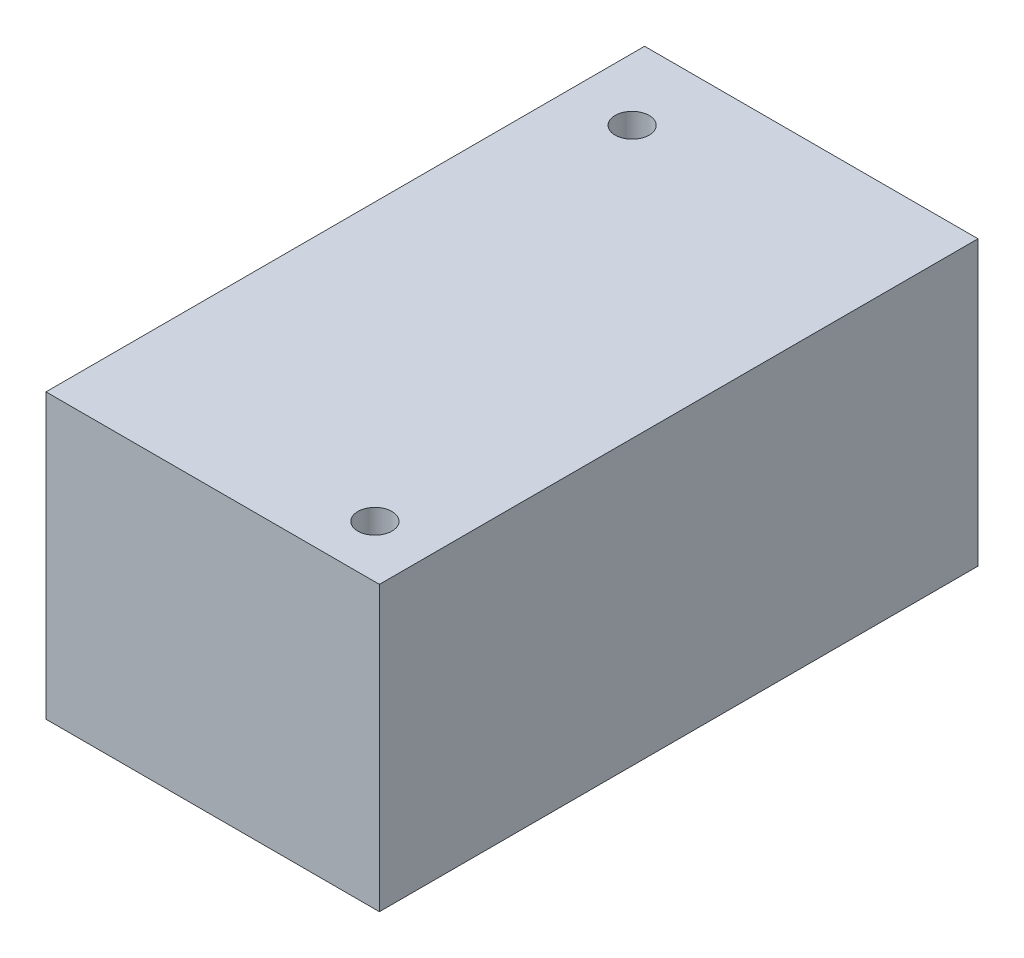
ISO-10303-21;
HEADER;
FILE_DESCRIPTION(('STEP AP214'),'2;1');
FILE_NAME('part.step','',(''),(''),'','','');
FILE_SCHEMA(('AUTOMOTIVE_DESIGN { 1 0 10303 214 1 1 1 1 }'));
ENDSEC;
DATA;
#1=APPLICATION_CONTEXT('core data for automotive mechanical design processes');
#2=APPLICATION_PROTOCOL_DEFINITION('international standard','automotive_design',2000,#1);
#3=PRODUCT_CONTEXT('',#1,'mechanical');
#4=PRODUCT('Part','Part','',(#3));
#5=PRODUCT_RELATED_PRODUCT_CATEGORY('part','',(#4));
#6=PRODUCT_DEFINITION_FORMATION('','',#4);
#7=PRODUCT_DEFINITION_CONTEXT('part definition',#1,'design');
#8=PRODUCT_DEFINITION('design','',#6,#7);
#9=PRODUCT_DEFINITION_SHAPE('','',#8);
#10=(LENGTH_UNIT() NAMED_UNIT(*) SI_UNIT(.MILLI.,.METRE.));
#11=(NAMED_UNIT(*) PLANE_ANGLE_UNIT() SI_UNIT($,.RADIAN.));
#12=(NAMED_UNIT(*) SI_UNIT($,.STERADIAN.) SOLID_ANGLE_UNIT());
#13=UNCERTAINTY_MEASURE_WITH_UNIT(LENGTH_MEASURE(1.E-05),#10,'distance_accuracy_value','');
#14=(GEOMETRIC_REPRESENTATION_CONTEXT(3) GLOBAL_UNCERTAINTY_ASSIGNED_CONTEXT((#13)) GLOBAL_UNIT_ASSIGNED_CONTEXT((#10,
#11,#12)) REPRESENTATION_CONTEXT('',''));
#15=CARTESIAN_POINT('',(0.,0.,0.));
#16=DIRECTION('',(0.,0.,1.));
#17=DIRECTION('',(1.,0.,0.));
#18=AXIS2_PLACEMENT_3D('',#15,#16,#17);
#19=CARTESIAN_POINT('',(63.5,45.,228.));
#20=DIRECTION('',(-1.,0.,0.));
#21=DIRECTION('',(0.,-1.,0.));
#22=AXIS2_PLACEMENT_3D('',#19,#20,#21);
#23=PLANE('',#22);
#24=DIRECTION('',(0.,1.,0.));
#25=VECTOR('',#24,1.);
#26=CARTESIAN_POINT('',(63.5,45.,0.));
#27=LINE('',#26,#25);
#28=CARTESIAN_POINT('',(63.5,-45.,0.));
#29=VERTEX_POINT('',#28);
#30=CARTESIAN_POINT('',(63.5,63.,0.));
#31=VERTEX_POINT('',#30);
#32=EDGE_CURVE('E113',#29,#31,#27,.T.);
#33=ORIENTED_EDGE('',*,*,#32,.T.);
#34=DIRECTION('',(0.,0.,-1.));
#35=VECTOR('',#34,1.);
#36=CARTESIAN_POINT('',(63.5,63.,228.));
#37=LINE('',#36,#35);
#38=CARTESIAN_POINT('',(63.5,63.,228.));
#39=VERTEX_POINT('',#38);
#40=EDGE_CURVE('E95',#39,#31,#37,.T.);
#41=ORIENTED_EDGE('',*,*,#40,.F.);
#42=DIRECTION('',(0.,1.,0.));
#43=VECTOR('',#42,1.);
#44=CARTESIAN_POINT('',(63.5,45.,228.));
#45=LINE('',#44,#43);
#46=CARTESIAN_POINT('',(63.5,-45.,228.));
#47=VERTEX_POINT('',#46);
#48=EDGE_CURVE('E86',#47,#39,#45,.T.);
#49=ORIENTED_EDGE('',*,*,#48,.F.);
#50=DIRECTION('',(0.,0.,-1.));
#51=VECTOR('',#50,1.);
#52=CARTESIAN_POINT('',(63.5,-45.,228.));
#53=LINE('',#52,#51);
#54=EDGE_CURVE('E47',#47,#29,#53,.T.);
#55=ORIENTED_EDGE('',*,*,#54,.T.);
#56=EDGE_LOOP('',(#33,#41,#49,#55));
#57=FACE_BOUND('',#56,.T.);
#58=ADVANCED_FACE('F38',(#57),#23,.F.);
#59=CARTESIAN_POINT('',(-63.5,45.,228.));
#60=DIRECTION('',(1.,0.,0.));
#61=DIRECTION('',(0.,1.,0.));
#62=AXIS2_PLACEMENT_3D('',#59,#60,#61);
#63=PLANE('',#62);
#64=DIRECTION('',(0.,-1.,0.));
#65=VECTOR('',#64,1.);
#66=CARTESIAN_POINT('',(-63.5,45.,0.));
#67=LINE('',#66,#65);
#68=CARTESIAN_POINT('',(-63.5,63.,0.));
#69=VERTEX_POINT('',#68);
#70=CARTESIAN_POINT('',(-63.5,-45.,0.));
#71=VERTEX_POINT('',#70);
#72=EDGE_CURVE('E67',#69,#71,#67,.T.);
#73=ORIENTED_EDGE('',*,*,#72,.T.);
#74=DIRECTION('',(0.,0.,-1.));
#75=VECTOR('',#74,1.);
#76=CARTESIAN_POINT('',(-63.5,-45.,228.));
#77=LINE('',#76,#75);
#78=CARTESIAN_POINT('',(-63.5,-45.,228.));
#79=VERTEX_POINT('',#78);
#80=EDGE_CURVE('E11',#79,#71,#77,.T.);
#81=ORIENTED_EDGE('',*,*,#80,.F.);
#82=DIRECTION('',(0.,-1.,0.));
#83=VECTOR('',#82,1.);
#84=CARTESIAN_POINT('',(-63.5,45.,228.));
#85=LINE('',#84,#83);
#86=CARTESIAN_POINT('',(-63.5,63.,228.));
#87=VERTEX_POINT('',#86);
#88=EDGE_CURVE('E81',#87,#79,#85,.T.);
#89=ORIENTED_EDGE('',*,*,#88,.F.);
#90=DIRECTION('',(0.,0.,1.));
#91=VECTOR('',#90,1.);
#92=CARTESIAN_POINT('',(-63.5,63.,228.));
#93=LINE('',#92,#91);
#94=EDGE_CURVE('E85',#69,#87,#93,.T.);
#95=ORIENTED_EDGE('',*,*,#94,.F.);
#96=EDGE_LOOP('',(#73,#81,#89,#95));
#97=FACE_BOUND('',#96,.T.);
#98=ADVANCED_FACE('F83',(#97),#63,.F.);
#99=CARTESIAN_POINT('',(-63.5,-45.,228.));
#100=DIRECTION('',(0.,1.,0.));
#101=DIRECTION('',(0.,0.,1.));
#102=AXIS2_PLACEMENT_3D('',#99,#100,#101);
#103=PLANE('',#102);
#104=CARTESIAN_POINT('',(41.8434939518879,-45.,208.062813639813));
#105=DIRECTION('',(0.,1.,0.));
#106=DIRECTION('',(0.,0.,1.));
#107=AXIS2_PLACEMENT_3D('',#104,#105,#106);
#108=CIRCLE('',#107,6.5);
#109=CARTESIAN_POINT('',(41.8434939518879,-45.,214.562813639813));
#110=VERTEX_POINT('',#109);
#111=EDGE_CURVE('E41',#110,#110,#108,.T.);
#112=ORIENTED_EDGE('',*,*,#111,.T.);
#113=EDGE_LOOP('',(#112));
#114=FACE_BOUND('',#113,.T.);
#115=CARTESIAN_POINT('',(-39.8023479054543,-45.,28.4419615536599));
#116=DIRECTION('',(0.,1.,0.));
#117=DIRECTION('',(0.,0.,1.));
#118=AXIS2_PLACEMENT_3D('',#115,#116,#117);
#119=CIRCLE('',#118,6.5);
#120=CARTESIAN_POINT('',(-39.8023479054543,-45.,34.9419615536599));
#121=VERTEX_POINT('',#120);
#122=EDGE_CURVE('E109',#121,#121,#119,.T.);
#123=ORIENTED_EDGE('',*,*,#122,.T.);
#124=EDGE_LOOP('',(#123));
#125=FACE_BOUND('',#124,.T.);
#126=DIRECTION('',(1.,0.,0.));
#127=VECTOR('',#126,1.);
#128=CARTESIAN_POINT('',(-63.5,-45.,0.));
#129=LINE('',#128,#127);
#130=EDGE_CURVE('E110',#71,#29,#129,.T.);
#131=ORIENTED_EDGE('',*,*,#130,.T.);
#132=ORIENTED_EDGE('',*,*,#54,.F.);
#133=DIRECTION('',(1.,0.,0.));
#134=VECTOR('',#133,1.);
#135=CARTESIAN_POINT('',(-63.5,-45.,228.));
#136=LINE('',#135,#134);
#137=EDGE_CURVE('E56',#79,#47,#136,.T.);
#138=ORIENTED_EDGE('',*,*,#137,.F.);
#139=ORIENTED_EDGE('',*,*,#80,.T.);
#140=EDGE_LOOP('',(#131,#132,#138,#139));
#141=FACE_BOUND('',#140,.T.);
#142=ADVANCED_FACE('F124',(#114,#125,#141),#103,.F.);
#143=CARTESIAN_POINT('',(0.,0.,228.));
#144=DIRECTION('',(0.,0.,1.));
#145=DIRECTION('',(1.,0.,0.));
#146=AXIS2_PLACEMENT_3D('',#143,#144,#145);
#147=PLANE('',#146);
#148=ORIENTED_EDGE('',*,*,#48,.T.);
#149=DIRECTION('',(1.,0.,0.));
#150=VECTOR('',#149,1.);
#151=CARTESIAN_POINT('',(-63.5,63.,228.));
#152=LINE('',#151,#150);
#153=EDGE_CURVE('E89',#87,#39,#152,.T.);
#154=ORIENTED_EDGE('',*,*,#153,.F.);
#155=ORIENTED_EDGE('',*,*,#88,.T.);
#156=ORIENTED_EDGE('',*,*,#137,.T.);
#157=EDGE_LOOP('',(#148,#154,#155,#156));
#158=FACE_BOUND('',#157,.T.);
#159=ADVANCED_FACE('F90',(#158),#147,.T.);
#160=CARTESIAN_POINT('',(0.,0.,0.));
#161=DIRECTION('',(0.,0.,1.));
#162=DIRECTION('',(1.,0.,0.));
#163=AXIS2_PLACEMENT_3D('',#160,#161,#162);
#164=PLANE('',#163);
#165=ORIENTED_EDGE('',*,*,#32,.F.);
#166=ORIENTED_EDGE('',*,*,#130,.F.);
#167=ORIENTED_EDGE('',*,*,#72,.F.);
#168=DIRECTION('',(-1.,0.,0.));
#169=VECTOR('',#168,1.);
#170=CARTESIAN_POINT('',(-63.5,63.,0.));
#171=LINE('',#170,#169);
#172=EDGE_CURVE('E99',#31,#69,#171,.T.);
#173=ORIENTED_EDGE('',*,*,#172,.F.);
#174=EDGE_LOOP('',(#165,#166,#167,#173));
#175=FACE_BOUND('',#174,.T.);
#176=ADVANCED_FACE('F144',(#175),#164,.F.);
#177=CARTESIAN_POINT('',(-39.8023479054543,-183.,28.4419615536599));
#178=DIRECTION('',(0.,1.,0.));
#179=DIRECTION('',(0.,0.,1.));
#180=AXIS2_PLACEMENT_3D('',#177,#178,#179);
#181=CYLINDRICAL_SURFACE('',#180,6.5);
#182=ORIENTED_EDGE('',*,*,#122,.F.);
#183=EDGE_LOOP('',(#182));
#184=FACE_BOUND('',#183,.T.);
#185=CARTESIAN_POINT('',(-39.8023479054543,63.,28.4419615536599));
#186=DIRECTION('',(0.,1.,0.));
#187=DIRECTION('',(0.,0.,1.));
#188=AXIS2_PLACEMENT_3D('',#185,#186,#187);
#189=CIRCLE('',#188,6.5);
#190=CARTESIAN_POINT('',(-39.8023479054543,63.,34.9419615536599));
#191=VERTEX_POINT('',#190);
#192=EDGE_CURVE('E100',#191,#191,#189,.T.);
#193=ORIENTED_EDGE('',*,*,#192,.T.);
#194=EDGE_LOOP('',(#193));
#195=FACE_BOUND('',#194,.T.);
#196=ADVANCED_FACE('F129',(#184,#195),#181,.F.);
#197=CARTESIAN_POINT('',(41.8434939518879,-183.,208.062813639813));
#198=DIRECTION('',(0.,1.,0.));
#199=DIRECTION('',(0.,0.,1.));
#200=AXIS2_PLACEMENT_3D('',#197,#198,#199);
#201=CYLINDRICAL_SURFACE('',#200,6.5);
#202=ORIENTED_EDGE('',*,*,#111,.F.);
#203=EDGE_LOOP('',(#202));
#204=FACE_BOUND('',#203,.T.);
#205=CARTESIAN_POINT('',(41.8434939518879,63.,208.062813639813));
#206=DIRECTION('',(0.,1.,0.));
#207=DIRECTION('',(0.,0.,1.));
#208=AXIS2_PLACEMENT_3D('',#205,#206,#207);
#209=CIRCLE('',#208,6.50000000000001);
#210=CARTESIAN_POINT('',(41.8434939518879,63.,214.562813639813));
#211=VERTEX_POINT('',#210);
#212=EDGE_CURVE('E103',#211,#211,#209,.T.);
#213=ORIENTED_EDGE('',*,*,#212,.T.);
#214=EDGE_LOOP('',(#213));
#215=FACE_BOUND('',#214,.T.);
#216=ADVANCED_FACE('F126',(#204,#215),#201,.F.);
#217=CARTESIAN_POINT('',(0.,63.,0.));
#218=DIRECTION('',(0.,-1.,0.));
#219=DIRECTION('',(0.,0.,-1.));
#220=AXIS2_PLACEMENT_3D('',#217,#218,#219);
#221=PLANE('',#220);
#222=ORIENTED_EDGE('',*,*,#94,.T.);
#223=ORIENTED_EDGE('',*,*,#153,.T.);
#224=ORIENTED_EDGE('',*,*,#40,.T.);
#225=ORIENTED_EDGE('',*,*,#172,.T.);
#226=EDGE_LOOP('',(#222,#223,#224,#225));
#227=FACE_BOUND('',#226,.T.);
#228=ORIENTED_EDGE('',*,*,#192,.F.);
#229=EDGE_LOOP('',(#228));
#230=FACE_BOUND('',#229,.T.);
#231=ORIENTED_EDGE('',*,*,#212,.F.);
#232=EDGE_LOOP('',(#231));
#233=FACE_BOUND('',#232,.T.);
#234=ADVANCED_FACE('F97',(#227,#230,#233),#221,.F.);
#235=CLOSED_SHELL('',(#58,#98,#142,#159,#176,#196,#216,#234));
#236=MANIFOLD_SOLID_BREP('B2',#235);
#237=ADVANCED_BREP_SHAPE_REPRESENTATION('',(#18,#236),#14);
#238=SHAPE_DEFINITION_REPRESENTATION(#9,#237);
ENDSEC;
END-ISO-10303-21;
